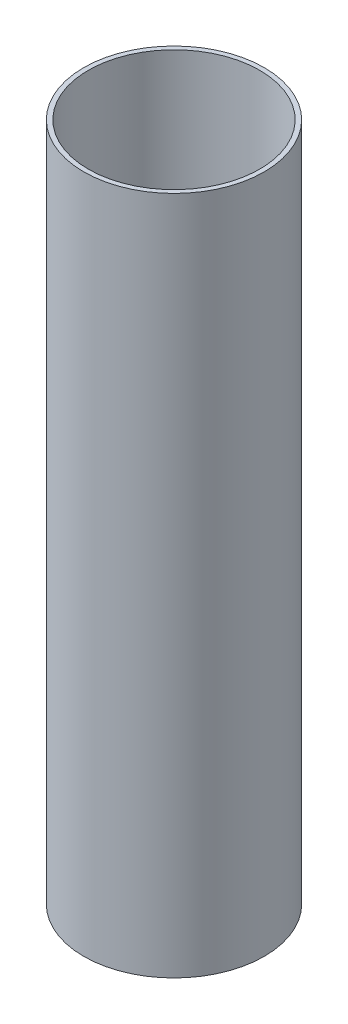
ISO-10303-21;
HEADER;
FILE_DESCRIPTION(('STEP AP214'),'2;1');
FILE_NAME('part.step','',(''),(''),'','','');
FILE_SCHEMA(('AUTOMOTIVE_DESIGN { 1 0 10303 214 1 1 1 1 }'));
ENDSEC;
DATA;
#1=APPLICATION_CONTEXT('core data for automotive mechanical design processes');
#2=APPLICATION_PROTOCOL_DEFINITION('international standard','automotive_design',2000,#1);
#3=PRODUCT_CONTEXT('',#1,'mechanical');
#4=PRODUCT('Part','Part','',(#3));
#5=PRODUCT_RELATED_PRODUCT_CATEGORY('part','',(#4));
#6=PRODUCT_DEFINITION_FORMATION('','',#4);
#7=PRODUCT_DEFINITION_CONTEXT('part definition',#1,'design');
#8=PRODUCT_DEFINITION('design','',#6,#7);
#9=PRODUCT_DEFINITION_SHAPE('','',#8);
#10=(LENGTH_UNIT() NAMED_UNIT(*) SI_UNIT(.MILLI.,.METRE.));
#11=(NAMED_UNIT(*) PLANE_ANGLE_UNIT() SI_UNIT($,.RADIAN.));
#12=(NAMED_UNIT(*) SI_UNIT($,.STERADIAN.) SOLID_ANGLE_UNIT());
#13=UNCERTAINTY_MEASURE_WITH_UNIT(LENGTH_MEASURE(1.E-05),#10,'distance_accuracy_value','');
#14=(GEOMETRIC_REPRESENTATION_CONTEXT(3) GLOBAL_UNCERTAINTY_ASSIGNED_CONTEXT((#13)) GLOBAL_UNIT_ASSIGNED_CONTEXT((#10,
#11,#12)) REPRESENTATION_CONTEXT('',''));
#15=CARTESIAN_POINT('',(0.,0.,0.));
#16=DIRECTION('',(0.,0.,1.));
#17=DIRECTION('',(1.,0.,0.));
#18=AXIS2_PLACEMENT_3D('',#15,#16,#17);
#19=CARTESIAN_POINT('',(0.,352.425,0.));
#20=DIRECTION('',(0.,1.,0.));
#21=DIRECTION('',(0.,0.,1.));
#22=AXIS2_PLACEMENT_3D('',#19,#20,#21);
#23=PLANE('',#22);
#24=CARTESIAN_POINT('',(0.,352.425,0.));
#25=DIRECTION('',(0.,1.,0.));
#26=DIRECTION('',(0.,0.,1.));
#27=AXIS2_PLACEMENT_3D('',#24,#25,#26);
#28=CIRCLE('',#27,93.6625);
#29=CARTESIAN_POINT('',(0.,352.425,93.6625));
#30=VERTEX_POINT('',#29);
#31=EDGE_CURVE('E10',#30,#30,#28,.T.);
#32=ORIENTED_EDGE('',*,*,#31,.T.);
#33=EDGE_LOOP('',(#32));
#34=FACE_BOUND('',#33,.T.);
#35=CARTESIAN_POINT('',(0.,352.425,0.));
#36=DIRECTION('',(0.,1.,0.));
#37=DIRECTION('',(0.,0.,1.));
#38=AXIS2_PLACEMENT_3D('',#35,#36,#37);
#39=CIRCLE('',#38,88.9);
#40=CARTESIAN_POINT('',(0.,352.425,88.9));
#41=VERTEX_POINT('',#40);
#42=EDGE_CURVE('E50',#41,#41,#39,.T.);
#43=ORIENTED_EDGE('',*,*,#42,.F.);
#44=EDGE_LOOP('',(#43));
#45=FACE_BOUND('',#44,.T.);
#46=ADVANCED_FACE('F37',(#34,#45),#23,.T.);
#47=CARTESIAN_POINT('',(0.,-352.425,0.));
#48=DIRECTION('',(0.,1.,0.));
#49=DIRECTION('',(0.,0.,1.));
#50=AXIS2_PLACEMENT_3D('',#47,#48,#49);
#51=PLANE('',#50);
#52=CARTESIAN_POINT('',(0.,-352.425,0.));
#53=DIRECTION('',(0.,1.,0.));
#54=DIRECTION('',(0.,0.,1.));
#55=AXIS2_PLACEMENT_3D('',#52,#53,#54);
#56=CIRCLE('',#55,93.6625);
#57=CARTESIAN_POINT('',(0.,-352.425,93.6625));
#58=VERTEX_POINT('',#57);
#59=EDGE_CURVE('E41',#58,#58,#56,.T.);
#60=ORIENTED_EDGE('',*,*,#59,.F.);
#61=EDGE_LOOP('',(#60));
#62=FACE_BOUND('',#61,.T.);
#63=CARTESIAN_POINT('',(0.,-352.425,0.));
#64=DIRECTION('',(0.,1.,0.));
#65=DIRECTION('',(0.,0.,1.));
#66=AXIS2_PLACEMENT_3D('',#63,#64,#65);
#67=CIRCLE('',#66,88.9);
#68=CARTESIAN_POINT('',(0.,-352.425,88.9));
#69=VERTEX_POINT('',#68);
#70=EDGE_CURVE('E52',#69,#69,#67,.T.);
#71=ORIENTED_EDGE('',*,*,#70,.T.);
#72=EDGE_LOOP('',(#71));
#73=FACE_BOUND('',#72,.T.);
#74=ADVANCED_FACE('F64',(#62,#73),#51,.F.);
#75=CARTESIAN_POINT('',(0.,352.425,0.));
#76=DIRECTION('',(0.,-1.,0.));
#77=DIRECTION('',(0.,0.,-1.));
#78=AXIS2_PLACEMENT_3D('',#75,#76,#77);
#79=CYLINDRICAL_SURFACE('',#78,93.6625);
#80=ORIENTED_EDGE('',*,*,#31,.F.);
#81=EDGE_LOOP('',(#80));
#82=FACE_BOUND('',#81,.T.);
#83=ORIENTED_EDGE('',*,*,#59,.T.);
#84=EDGE_LOOP('',(#83));
#85=FACE_BOUND('',#84,.T.);
#86=ADVANCED_FACE('F39',(#82,#85),#79,.T.);
#87=CARTESIAN_POINT('',(0.,352.425,0.));
#88=DIRECTION('',(0.,-1.,0.));
#89=DIRECTION('',(0.,0.,-1.));
#90=AXIS2_PLACEMENT_3D('',#87,#88,#89);
#91=CYLINDRICAL_SURFACE('',#90,88.9);
#92=ORIENTED_EDGE('',*,*,#42,.T.);
#93=EDGE_LOOP('',(#92));
#94=FACE_BOUND('',#93,.T.);
#95=ORIENTED_EDGE('',*,*,#70,.F.);
#96=EDGE_LOOP('',(#95));
#97=FACE_BOUND('',#96,.T.);
#98=ADVANCED_FACE('F60',(#94,#97),#91,.F.);
#99=CLOSED_SHELL('',(#46,#74,#86,#98));
#100=MANIFOLD_SOLID_BREP('B2',#99);
#101=ADVANCED_BREP_SHAPE_REPRESENTATION('',(#18,#100),#14);
#102=SHAPE_DEFINITION_REPRESENTATION(#9,#101);
ENDSEC;
END-ISO-10303-21;
